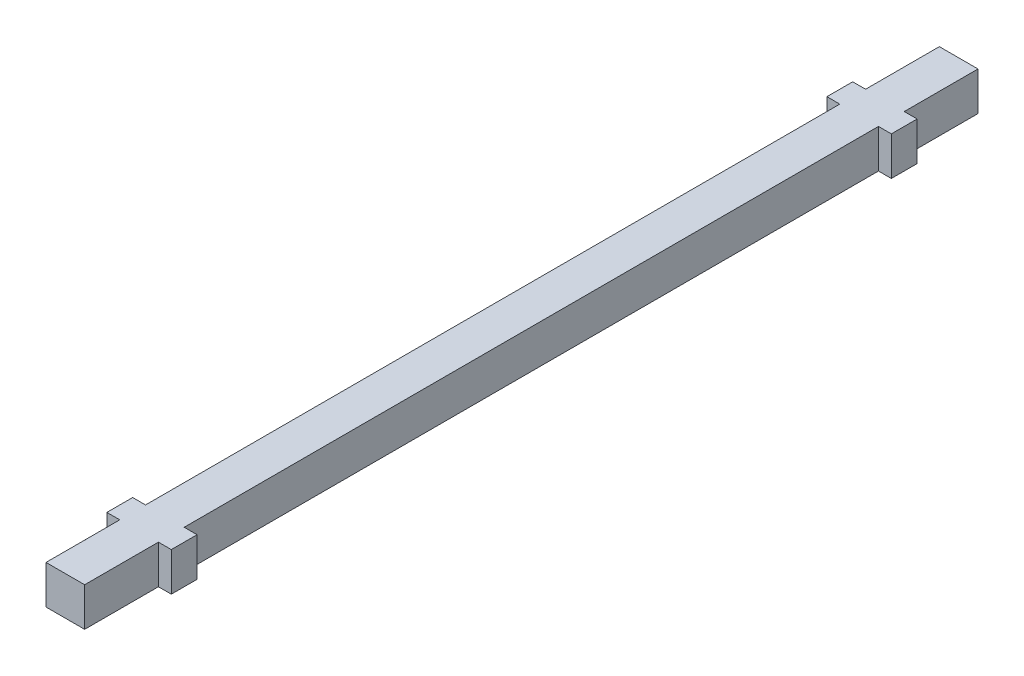
ISO-10303-21;
HEADER;
FILE_DESCRIPTION(('STEP AP214'),'2;1');
FILE_NAME('part.step','',(''),(''),'','','');
FILE_SCHEMA(('AUTOMOTIVE_DESIGN { 1 0 10303 214 1 1 1 1 }'));
ENDSEC;
DATA;
#1=APPLICATION_CONTEXT('core data for automotive mechanical design processes');
#2=APPLICATION_PROTOCOL_DEFINITION('international standard','automotive_design',2000,#1);
#3=PRODUCT_CONTEXT('',#1,'mechanical');
#4=PRODUCT('Part','Part','',(#3));
#5=PRODUCT_RELATED_PRODUCT_CATEGORY('part','',(#4));
#6=PRODUCT_DEFINITION_FORMATION('','',#4);
#7=PRODUCT_DEFINITION_CONTEXT('part definition',#1,'design');
#8=PRODUCT_DEFINITION('design','',#6,#7);
#9=PRODUCT_DEFINITION_SHAPE('','',#8);
#10=(LENGTH_UNIT() NAMED_UNIT(*) SI_UNIT(.MILLI.,.METRE.));
#11=(NAMED_UNIT(*) PLANE_ANGLE_UNIT() SI_UNIT($,.RADIAN.));
#12=(NAMED_UNIT(*) SI_UNIT($,.STERADIAN.) SOLID_ANGLE_UNIT());
#13=UNCERTAINTY_MEASURE_WITH_UNIT(LENGTH_MEASURE(1.E-05),#10,'distance_accuracy_value','');
#14=(GEOMETRIC_REPRESENTATION_CONTEXT(3) GLOBAL_UNCERTAINTY_ASSIGNED_CONTEXT((#13)) GLOBAL_UNIT_ASSIGNED_CONTEXT((#10,
#11,#12)) REPRESENTATION_CONTEXT('',''));
#15=CARTESIAN_POINT('',(0.,0.,0.));
#16=DIRECTION('',(0.,0.,1.));
#17=DIRECTION('',(1.,0.,0.));
#18=AXIS2_PLACEMENT_3D('',#15,#16,#17);
#19=CARTESIAN_POINT('',(-4.5,-4.5,104.));
#20=DIRECTION('',(1.,0.,0.));
#21=DIRECTION('',(0.,0.,-1.));
#22=AXIS2_PLACEMENT_3D('',#19,#20,#21);
#23=PLANE('',#22);
#24=DIRECTION('',(0.,-1.,0.));
#25=VECTOR('',#24,1.);
#26=CARTESIAN_POINT('',(-4.5,4.5,-86.825));
#27=LINE('',#26,#25);
#28=CARTESIAN_POINT('',(-4.5,4.5,-86.825));
#29=VERTEX_POINT('',#28);
#30=CARTESIAN_POINT('',(-4.5,-4.5,-86.825));
#31=VERTEX_POINT('',#30);
#32=EDGE_CURVE('E192',#29,#31,#27,.T.);
#33=ORIENTED_EDGE('',*,*,#32,.F.);
#34=DIRECTION('',(0.,0.,-1.));
#35=VECTOR('',#34,1.);
#36=CARTESIAN_POINT('',(-4.5,4.5,104.));
#37=LINE('',#36,#35);
#38=CARTESIAN_POINT('',(-4.5,4.5,-104.));
#39=VERTEX_POINT('',#38);
#40=EDGE_CURVE('E210',#29,#39,#37,.T.);
#41=ORIENTED_EDGE('',*,*,#40,.T.);
#42=DIRECTION('',(0.,-1.,0.));
#43=VECTOR('',#42,1.);
#44=CARTESIAN_POINT('',(-4.5,-4.5,-104.));
#45=LINE('',#44,#43);
#46=CARTESIAN_POINT('',(-4.5,-4.5,-104.));
#47=VERTEX_POINT('',#46);
#48=EDGE_CURVE('E227',#39,#47,#45,.T.);
#49=ORIENTED_EDGE('',*,*,#48,.T.);
#50=DIRECTION('',(0.,0.,-1.));
#51=VECTOR('',#50,1.);
#52=CARTESIAN_POINT('',(-4.5,-4.5,104.));
#53=LINE('',#52,#51);
#54=EDGE_CURVE('E217',#31,#47,#53,.T.);
#55=ORIENTED_EDGE('',*,*,#54,.F.);
#56=EDGE_LOOP('',(#33,#41,#49,#55));
#57=FACE_BOUND('',#56,.T.);
#58=ADVANCED_FACE('F43',(#57),#23,.F.);
#59=CARTESIAN_POINT('',(4.5,-4.5,104.));
#60=DIRECTION('',(-1.,0.,0.));
#61=DIRECTION('',(0.,0.,1.));
#62=AXIS2_PLACEMENT_3D('',#59,#60,#61);
#63=PLANE('',#62);
#64=DIRECTION('',(0.,0.,-1.));
#65=VECTOR('',#64,1.);
#66=CARTESIAN_POINT('',(4.5,-4.5,104.));
#67=LINE('',#66,#65);
#68=CARTESIAN_POINT('',(4.5,-4.5,80.825));
#69=VERTEX_POINT('',#68);
#70=CARTESIAN_POINT('',(4.5,-4.5,-80.8249999999999));
#71=VERTEX_POINT('',#70);
#72=EDGE_CURVE('E221',#69,#71,#67,.T.);
#73=ORIENTED_EDGE('',*,*,#72,.T.);
#74=DIRECTION('',(0.,-1.,0.));
#75=VECTOR('',#74,1.);
#76=CARTESIAN_POINT('',(4.5,4.5,-80.825));
#77=LINE('',#76,#75);
#78=CARTESIAN_POINT('',(4.5,4.5,-80.8249999999999));
#79=VERTEX_POINT('',#78);
#80=EDGE_CURVE('E298',#79,#71,#77,.T.);
#81=ORIENTED_EDGE('',*,*,#80,.F.);
#82=DIRECTION('',(0.,0.,-1.));
#83=VECTOR('',#82,1.);
#84=CARTESIAN_POINT('',(4.5,4.5,104.));
#85=LINE('',#84,#83);
#86=CARTESIAN_POINT('',(4.5,4.5,80.825));
#87=VERTEX_POINT('',#86);
#88=EDGE_CURVE('E51',#87,#79,#85,.T.);
#89=ORIENTED_EDGE('',*,*,#88,.F.);
#90=DIRECTION('',(0.,-1.,0.));
#91=VECTOR('',#90,1.);
#92=CARTESIAN_POINT('',(4.5,4.5,80.825));
#93=LINE('',#92,#91);
#94=EDGE_CURVE('E261',#87,#69,#93,.T.);
#95=ORIENTED_EDGE('',*,*,#94,.T.);
#96=EDGE_LOOP('',(#73,#81,#89,#95));
#97=FACE_BOUND('',#96,.T.);
#98=ADVANCED_FACE('F350',(#97),#63,.F.);
#99=DIRECTION('',(0.,-1.,0.));
#100=VECTOR('',#99,1.);
#101=CARTESIAN_POINT('',(4.5,4.5,86.825));
#102=LINE('',#101,#100);
#103=CARTESIAN_POINT('',(4.5,4.5,86.825));
#104=VERTEX_POINT('',#103);
#105=CARTESIAN_POINT('',(4.5,-4.5,86.825));
#106=VERTEX_POINT('',#105);
#107=EDGE_CURVE('E269',#104,#106,#102,.T.);
#108=ORIENTED_EDGE('',*,*,#107,.F.);
#109=CARTESIAN_POINT('',(4.5,4.5,104.));
#110=VERTEX_POINT('',#109);
#111=EDGE_CURVE('E11',#110,#104,#85,.T.);
#112=ORIENTED_EDGE('',*,*,#111,.F.);
#113=DIRECTION('',(0.,1.,0.));
#114=VECTOR('',#113,1.);
#115=CARTESIAN_POINT('',(4.5,-4.5,104.));
#116=LINE('',#115,#114);
#117=CARTESIAN_POINT('',(4.5,-4.5,104.));
#118=VERTEX_POINT('',#117);
#119=EDGE_CURVE('E226',#118,#110,#116,.T.);
#120=ORIENTED_EDGE('',*,*,#119,.F.);
#121=EDGE_CURVE('E218',#118,#106,#67,.T.);
#122=ORIENTED_EDGE('',*,*,#121,.T.);
#123=EDGE_LOOP('',(#108,#112,#120,#122));
#124=FACE_BOUND('',#123,.T.);
#125=ADVANCED_FACE('F381',(#124),#63,.F.);
#126=CARTESIAN_POINT('',(-4.5,4.5,80.825));
#127=VERTEX_POINT('',#126);
#128=CARTESIAN_POINT('',(-4.5,4.5,-80.825));
#129=VERTEX_POINT('',#128);
#130=EDGE_CURVE('E199',#127,#129,#37,.T.);
#131=ORIENTED_EDGE('',*,*,#130,.T.);
#132=DIRECTION('',(0.,-1.,0.));
#133=VECTOR('',#132,1.);
#134=CARTESIAN_POINT('',(-4.5,4.5,-80.825));
#135=LINE('',#134,#133);
#136=CARTESIAN_POINT('',(-4.5,-4.5,-80.825));
#137=VERTEX_POINT('',#136);
#138=EDGE_CURVE('E181',#129,#137,#135,.T.);
#139=ORIENTED_EDGE('',*,*,#138,.T.);
#140=CARTESIAN_POINT('',(-4.5,-4.5,80.825));
#141=VERTEX_POINT('',#140);
#142=EDGE_CURVE('E216',#141,#137,#53,.T.);
#143=ORIENTED_EDGE('',*,*,#142,.F.);
#144=DIRECTION('',(0.,-1.,0.));
#145=VECTOR('',#144,1.);
#146=CARTESIAN_POINT('',(-4.5,4.5,80.825));
#147=LINE('',#146,#145);
#148=EDGE_CURVE('E208',#127,#141,#147,.T.);
#149=ORIENTED_EDGE('',*,*,#148,.F.);
#150=EDGE_LOOP('',(#131,#139,#143,#149));
#151=FACE_BOUND('',#150,.T.);
#152=ADVANCED_FACE('F207',(#151),#23,.F.);
#153=CARTESIAN_POINT('',(4.5,4.5,-86.8249999999999));
#154=VERTEX_POINT('',#153);
#155=CARTESIAN_POINT('',(4.5,4.5,-104.));
#156=VERTEX_POINT('',#155);
#157=EDGE_CURVE('E52',#154,#156,#85,.T.);
#158=ORIENTED_EDGE('',*,*,#157,.F.);
#159=DIRECTION('',(0.,-1.,0.));
#160=VECTOR('',#159,1.);
#161=CARTESIAN_POINT('',(4.5,4.5,-86.825));
#162=LINE('',#161,#160);
#163=CARTESIAN_POINT('',(4.5,-4.5,-86.825));
#164=VERTEX_POINT('',#163);
#165=EDGE_CURVE('E296',#154,#164,#162,.T.);
#166=ORIENTED_EDGE('',*,*,#165,.T.);
#167=CARTESIAN_POINT('',(4.5,-4.5,-104.));
#168=VERTEX_POINT('',#167);
#169=EDGE_CURVE('E222',#164,#168,#67,.T.);
#170=ORIENTED_EDGE('',*,*,#169,.T.);
#171=DIRECTION('',(0.,1.,0.));
#172=VECTOR('',#171,1.);
#173=CARTESIAN_POINT('',(4.5,-4.5,-104.));
#174=LINE('',#173,#172);
#175=EDGE_CURVE('E232',#168,#156,#174,.T.);
#176=ORIENTED_EDGE('',*,*,#175,.T.);
#177=EDGE_LOOP('',(#158,#166,#170,#176));
#178=FACE_BOUND('',#177,.T.);
#179=ADVANCED_FACE('F45',(#178),#63,.F.);
#180=CARTESIAN_POINT('',(-4.5,4.5,104.));
#181=DIRECTION('',(0.,-1.,0.));
#182=DIRECTION('',(0.,0.,-1.));
#183=AXIS2_PLACEMENT_3D('',#180,#181,#182);
#184=PLANE('',#183);
#185=DIRECTION('',(-1.,0.,0.));
#186=VECTOR('',#185,1.);
#187=CARTESIAN_POINT('',(-4.5,4.5,-104.));
#188=LINE('',#187,#186);
#189=EDGE_CURVE('E230',#156,#39,#188,.T.);
#190=ORIENTED_EDGE('',*,*,#189,.T.);
#191=ORIENTED_EDGE('',*,*,#40,.F.);
#192=DIRECTION('',(-1.,0.,0.));
#193=VECTOR('',#192,1.);
#194=CARTESIAN_POINT('',(4.01646308804497E-13,4.5,-86.825));
#195=LINE('',#194,#193);
#196=CARTESIAN_POINT('',(-7.5,4.5,-86.825));
#197=VERTEX_POINT('',#196);
#198=EDGE_CURVE('E203',#29,#197,#195,.T.);
#199=ORIENTED_EDGE('',*,*,#198,.T.);
#200=DIRECTION('',(0.,0.,1.));
#201=VECTOR('',#200,1.);
#202=CARTESIAN_POINT('',(-7.5,4.5,0.));
#203=LINE('',#202,#201);
#204=CARTESIAN_POINT('',(-7.5,4.5,-80.825));
#205=VERTEX_POINT('',#204);
#206=EDGE_CURVE('E201',#197,#205,#203,.T.);
#207=ORIENTED_EDGE('',*,*,#206,.T.);
#208=DIRECTION('',(-1.,0.,0.));
#209=VECTOR('',#208,1.);
#210=CARTESIAN_POINT('',(0.,4.5,-80.825));
#211=LINE('',#210,#209);
#212=EDGE_CURVE('E184',#129,#205,#211,.T.);
#213=ORIENTED_EDGE('',*,*,#212,.F.);
#214=ORIENTED_EDGE('',*,*,#130,.F.);
#215=DIRECTION('',(1.,0.,0.));
#216=VECTOR('',#215,1.);
#217=CARTESIAN_POINT('',(0.,4.5,80.825));
#218=LINE('',#217,#216);
#219=CARTESIAN_POINT('',(-7.5,4.5,80.825));
#220=VERTEX_POINT('',#219);
#221=EDGE_CURVE('E254',#220,#127,#218,.T.);
#222=ORIENTED_EDGE('',*,*,#221,.F.);
#223=DIRECTION('',(0.,0.,1.));
#224=VECTOR('',#223,1.);
#225=CARTESIAN_POINT('',(-7.5,4.5,0.));
#226=LINE('',#225,#224);
#227=CARTESIAN_POINT('',(-7.5,4.5,86.825));
#228=VERTEX_POINT('',#227);
#229=EDGE_CURVE('E264',#220,#228,#226,.T.);
#230=ORIENTED_EDGE('',*,*,#229,.T.);
#231=DIRECTION('',(-1.,0.,0.));
#232=VECTOR('',#231,1.);
#233=CARTESIAN_POINT('',(4.01646308804497E-13,4.5,86.825));
#234=LINE('',#233,#232);
#235=CARTESIAN_POINT('',(-4.5,4.5,86.825));
#236=VERTEX_POINT('',#235);
#237=EDGE_CURVE('E250',#236,#228,#234,.T.);
#238=ORIENTED_EDGE('',*,*,#237,.F.);
#239=CARTESIAN_POINT('',(-4.5,4.5,104.));
#240=VERTEX_POINT('',#239);
#241=EDGE_CURVE('E209',#240,#236,#37,.T.);
#242=ORIENTED_EDGE('',*,*,#241,.F.);
#243=DIRECTION('',(-1.,0.,0.));
#244=VECTOR('',#243,1.);
#245=CARTESIAN_POINT('',(-4.5,4.5,104.));
#246=LINE('',#245,#244);
#247=EDGE_CURVE('E239',#110,#240,#246,.T.);
#248=ORIENTED_EDGE('',*,*,#247,.F.);
#249=ORIENTED_EDGE('',*,*,#111,.T.);
#250=DIRECTION('',(1.,0.,0.));
#251=VECTOR('',#250,1.);
#252=CARTESIAN_POINT('',(0.,4.5,86.825));
#253=LINE('',#252,#251);
#254=CARTESIAN_POINT('',(7.5,4.5,86.825));
#255=VERTEX_POINT('',#254);
#256=EDGE_CURVE('E289',#104,#255,#253,.T.);
#257=ORIENTED_EDGE('',*,*,#256,.T.);
#258=DIRECTION('',(0.,0.,1.));
#259=VECTOR('',#258,1.);
#260=CARTESIAN_POINT('',(7.5,4.5,0.));
#261=LINE('',#260,#259);
#262=CARTESIAN_POINT('',(7.5,4.5,80.825));
#263=VERTEX_POINT('',#262);
#264=EDGE_CURVE('E275',#263,#255,#261,.T.);
#265=ORIENTED_EDGE('',*,*,#264,.F.);
#266=DIRECTION('',(1.,0.,0.));
#267=VECTOR('',#266,1.);
#268=CARTESIAN_POINT('',(0.,4.5,80.825));
#269=LINE('',#268,#267);
#270=EDGE_CURVE('E279',#87,#263,#269,.T.);
#271=ORIENTED_EDGE('',*,*,#270,.F.);
#272=ORIENTED_EDGE('',*,*,#88,.T.);
#273=DIRECTION('',(-1.,0.,0.));
#274=VECTOR('',#273,1.);
#275=CARTESIAN_POINT('',(0.,4.5,-80.825));
#276=LINE('',#275,#274);
#277=CARTESIAN_POINT('',(7.5,4.5,-80.825));
#278=VERTEX_POINT('',#277);
#279=EDGE_CURVE('E305',#278,#79,#276,.T.);
#280=ORIENTED_EDGE('',*,*,#279,.F.);
#281=DIRECTION('',(0.,0.,1.));
#282=VECTOR('',#281,1.);
#283=CARTESIAN_POINT('',(7.5,4.5,0.));
#284=LINE('',#283,#282);
#285=CARTESIAN_POINT('',(7.5,4.5,-86.825));
#286=VERTEX_POINT('',#285);
#287=EDGE_CURVE('E313',#286,#278,#284,.T.);
#288=ORIENTED_EDGE('',*,*,#287,.F.);
#289=DIRECTION('',(1.,0.,0.));
#290=VECTOR('',#289,1.);
#291=CARTESIAN_POINT('',(0.,4.5,-86.825));
#292=LINE('',#291,#290);
#293=EDGE_CURVE('E301',#154,#286,#292,.T.);
#294=ORIENTED_EDGE('',*,*,#293,.F.);
#295=ORIENTED_EDGE('',*,*,#157,.T.);
#296=EDGE_LOOP('',(#190,#191,#199,#207,#213,#214,#222,#230,#238,#242,#248,#249,#257,#265,#271,
#272,#280,#288,#294,#295));
#297=FACE_BOUND('',#296,.T.);
#298=ADVANCED_FACE('F197',(#297),#184,.F.);
#299=ORIENTED_EDGE('',*,*,#241,.T.);
#300=DIRECTION('',(0.,-1.,0.));
#301=VECTOR('',#300,1.);
#302=CARTESIAN_POINT('',(-4.5,4.5,86.825));
#303=LINE('',#302,#301);
#304=CARTESIAN_POINT('',(-4.5,-4.5,86.825));
#305=VERTEX_POINT('',#304);
#306=EDGE_CURVE('E246',#236,#305,#303,.T.);
#307=ORIENTED_EDGE('',*,*,#306,.T.);
#308=CARTESIAN_POINT('',(-4.5,-4.5,104.));
#309=VERTEX_POINT('',#308);
#310=EDGE_CURVE('E212',#309,#305,#53,.T.);
#311=ORIENTED_EDGE('',*,*,#310,.F.);
#312=DIRECTION('',(0.,-1.,0.));
#313=VECTOR('',#312,1.);
#314=CARTESIAN_POINT('',(-4.5,-4.5,104.));
#315=LINE('',#314,#313);
#316=EDGE_CURVE('E237',#240,#309,#315,.T.);
#317=ORIENTED_EDGE('',*,*,#316,.F.);
#318=EDGE_LOOP('',(#299,#307,#311,#317));
#319=FACE_BOUND('',#318,.T.);
#320=ADVANCED_FACE('F376',(#319),#23,.F.);
#321=CARTESIAN_POINT('',(-4.5,-4.5,104.));
#322=DIRECTION('',(0.,1.,0.));
#323=DIRECTION('',(0.,0.,1.));
#324=AXIS2_PLACEMENT_3D('',#321,#322,#323);
#325=PLANE('',#324);
#326=DIRECTION('',(1.,0.,0.));
#327=VECTOR('',#326,1.);
#328=CARTESIAN_POINT('',(-4.5,-4.5,-104.));
#329=LINE('',#328,#327);
#330=EDGE_CURVE('E223',#47,#168,#329,.T.);
#331=ORIENTED_EDGE('',*,*,#330,.T.);
#332=ORIENTED_EDGE('',*,*,#169,.F.);
#333=DIRECTION('',(1.,0.,0.));
#334=VECTOR('',#333,1.);
#335=CARTESIAN_POINT('',(0.,-4.5,-86.825));
#336=LINE('',#335,#334);
#337=CARTESIAN_POINT('',(7.5,-4.5,-86.825));
#338=VERTEX_POINT('',#337);
#339=EDGE_CURVE('E302',#164,#338,#336,.T.);
#340=ORIENTED_EDGE('',*,*,#339,.T.);
#341=DIRECTION('',(0.,0.,1.));
#342=VECTOR('',#341,1.);
#343=CARTESIAN_POINT('',(7.5,-4.5,0.));
#344=LINE('',#343,#342);
#345=CARTESIAN_POINT('',(7.5,-4.5,-80.825));
#346=VERTEX_POINT('',#345);
#347=EDGE_CURVE('E306',#338,#346,#344,.T.);
#348=ORIENTED_EDGE('',*,*,#347,.T.);
#349=DIRECTION('',(-1.,0.,0.));
#350=VECTOR('',#349,1.);
#351=CARTESIAN_POINT('',(0.,-4.5,-80.825));
#352=LINE('',#351,#350);
#353=EDGE_CURVE('E191',#346,#71,#352,.T.);
#354=ORIENTED_EDGE('',*,*,#353,.T.);
#355=ORIENTED_EDGE('',*,*,#72,.F.);
#356=DIRECTION('',(1.,0.,0.));
#357=VECTOR('',#356,1.);
#358=CARTESIAN_POINT('',(0.,-4.5,80.825));
#359=LINE('',#358,#357);
#360=CARTESIAN_POINT('',(7.5,-4.5,80.825));
#361=VERTEX_POINT('',#360);
#362=EDGE_CURVE('E283',#69,#361,#359,.T.);
#363=ORIENTED_EDGE('',*,*,#362,.T.);
#364=DIRECTION('',(0.,0.,1.));
#365=VECTOR('',#364,1.);
#366=CARTESIAN_POINT('',(7.5,-4.5,0.));
#367=LINE('',#366,#365);
#368=CARTESIAN_POINT('',(7.5,-4.5,86.825));
#369=VERTEX_POINT('',#368);
#370=EDGE_CURVE('E276',#361,#369,#367,.T.);
#371=ORIENTED_EDGE('',*,*,#370,.T.);
#372=DIRECTION('',(1.,0.,0.));
#373=VECTOR('',#372,1.);
#374=CARTESIAN_POINT('',(0.,-4.5,86.825));
#375=LINE('',#374,#373);
#376=EDGE_CURVE('E280',#106,#369,#375,.T.);
#377=ORIENTED_EDGE('',*,*,#376,.F.);
#378=ORIENTED_EDGE('',*,*,#121,.F.);
#379=DIRECTION('',(1.,0.,0.));
#380=VECTOR('',#379,1.);
#381=CARTESIAN_POINT('',(-4.5,-4.5,104.));
#382=LINE('',#381,#380);
#383=EDGE_CURVE('E235',#309,#118,#382,.T.);
#384=ORIENTED_EDGE('',*,*,#383,.F.);
#385=ORIENTED_EDGE('',*,*,#310,.T.);
#386=DIRECTION('',(-1.,0.,0.));
#387=VECTOR('',#386,1.);
#388=CARTESIAN_POINT('',(4.01646308804497E-13,-4.5,86.825));
#389=LINE('',#388,#387);
#390=CARTESIAN_POINT('',(-7.5,-4.5,86.825));
#391=VERTEX_POINT('',#390);
#392=EDGE_CURVE('E251',#305,#391,#389,.T.);
#393=ORIENTED_EDGE('',*,*,#392,.T.);
#394=DIRECTION('',(0.,0.,1.));
#395=VECTOR('',#394,1.);
#396=CARTESIAN_POINT('',(-7.5,-4.5,0.));
#397=LINE('',#396,#395);
#398=CARTESIAN_POINT('',(-7.5,-4.5,80.825));
#399=VERTEX_POINT('',#398);
#400=EDGE_CURVE('E255',#399,#391,#397,.T.);
#401=ORIENTED_EDGE('',*,*,#400,.F.);
#402=DIRECTION('',(1.,0.,0.));
#403=VECTOR('',#402,1.);
#404=CARTESIAN_POINT('',(0.,-4.5,80.825));
#405=LINE('',#404,#403);
#406=EDGE_CURVE('E258',#399,#141,#405,.T.);
#407=ORIENTED_EDGE('',*,*,#406,.T.);
#408=ORIENTED_EDGE('',*,*,#142,.T.);
#409=DIRECTION('',(-1.,0.,0.));
#410=VECTOR('',#409,1.);
#411=CARTESIAN_POINT('',(0.,-4.5,-80.825));
#412=LINE('',#411,#410);
#413=CARTESIAN_POINT('',(-7.5,-4.5,-80.825));
#414=VERTEX_POINT('',#413);
#415=EDGE_CURVE('E186',#137,#414,#412,.T.);
#416=ORIENTED_EDGE('',*,*,#415,.T.);
#417=DIRECTION('',(0.,0.,1.));
#418=VECTOR('',#417,1.);
#419=CARTESIAN_POINT('',(-7.5,-4.5,0.));
#420=LINE('',#419,#418);
#421=CARTESIAN_POINT('',(-7.5,-4.5,-86.825));
#422=VERTEX_POINT('',#421);
#423=EDGE_CURVE('E204',#422,#414,#420,.T.);
#424=ORIENTED_EDGE('',*,*,#423,.F.);
#425=DIRECTION('',(-1.,0.,0.));
#426=VECTOR('',#425,1.);
#427=CARTESIAN_POINT('',(4.01646308804497E-13,-4.5,-86.825));
#428=LINE('',#427,#426);
#429=EDGE_CURVE('E59',#31,#422,#428,.T.);
#430=ORIENTED_EDGE('',*,*,#429,.F.);
#431=ORIENTED_EDGE('',*,*,#54,.T.);
#432=EDGE_LOOP('',(#331,#332,#340,#348,#354,#355,#363,#371,#377,#378,#384,#385,#393,#401,#407,
#408,#416,#424,#430,#431));
#433=FACE_BOUND('',#432,.T.);
#434=ADVANCED_FACE('F336',(#433),#325,.F.);
#435=CARTESIAN_POINT('',(0.,0.,104.));
#436=DIRECTION('',(0.,0.,-1.));
#437=DIRECTION('',(-1.,0.,0.));
#438=AXIS2_PLACEMENT_3D('',#435,#436,#437);
#439=PLANE('',#438);
#440=ORIENTED_EDGE('',*,*,#119,.T.);
#441=ORIENTED_EDGE('',*,*,#247,.T.);
#442=ORIENTED_EDGE('',*,*,#316,.T.);
#443=ORIENTED_EDGE('',*,*,#383,.T.);
#444=EDGE_LOOP('',(#440,#441,#442,#443));
#445=FACE_BOUND('',#444,.T.);
#446=ADVANCED_FACE('F390',(#445),#439,.F.);
#447=CARTESIAN_POINT('',(0.,0.,-104.));
#448=DIRECTION('',(0.,0.,-1.));
#449=DIRECTION('',(-1.,0.,0.));
#450=AXIS2_PLACEMENT_3D('',#447,#448,#449);
#451=PLANE('',#450);
#452=ORIENTED_EDGE('',*,*,#175,.F.);
#453=ORIENTED_EDGE('',*,*,#330,.F.);
#454=ORIENTED_EDGE('',*,*,#48,.F.);
#455=ORIENTED_EDGE('',*,*,#189,.F.);
#456=EDGE_LOOP('',(#452,#453,#454,#455));
#457=FACE_BOUND('',#456,.T.);
#458=ADVANCED_FACE('F346',(#457),#451,.T.);
#459=CARTESIAN_POINT('',(0.,4.5,80.825));
#460=DIRECTION('',(0.,0.,-1.));
#461=DIRECTION('',(-1.,0.,0.));
#462=AXIS2_PLACEMENT_3D('',#459,#460,#461);
#463=PLANE('',#462);
#464=ORIENTED_EDGE('',*,*,#406,.F.);
#465=DIRECTION('',(0.,-1.,0.));
#466=VECTOR('',#465,1.);
#467=CARTESIAN_POINT('',(-7.5,4.5,80.825));
#468=LINE('',#467,#466);
#469=EDGE_CURVE('E234',#220,#399,#468,.T.);
#470=ORIENTED_EDGE('',*,*,#469,.F.);
#471=ORIENTED_EDGE('',*,*,#221,.T.);
#472=ORIENTED_EDGE('',*,*,#148,.T.);
#473=EDGE_LOOP('',(#464,#470,#471,#472));
#474=FACE_BOUND('',#473,.T.);
#475=ADVANCED_FACE('F428',(#474),#463,.T.);
#476=CARTESIAN_POINT('',(-7.5,4.5,0.));
#477=DIRECTION('',(1.,0.,0.));
#478=DIRECTION('',(0.,0.,-1.));
#479=AXIS2_PLACEMENT_3D('',#476,#477,#478);
#480=PLANE('',#479);
#481=ORIENTED_EDGE('',*,*,#400,.T.);
#482=DIRECTION('',(0.,-1.,0.));
#483=VECTOR('',#482,1.);
#484=CARTESIAN_POINT('',(-7.5,4.5,86.825));
#485=LINE('',#484,#483);
#486=EDGE_CURVE('E244',#228,#391,#485,.T.);
#487=ORIENTED_EDGE('',*,*,#486,.F.);
#488=ORIENTED_EDGE('',*,*,#229,.F.);
#489=ORIENTED_EDGE('',*,*,#469,.T.);
#490=EDGE_LOOP('',(#481,#487,#488,#489));
#491=FACE_BOUND('',#490,.T.);
#492=ADVANCED_FACE('F422',(#491),#480,.F.);
#493=CARTESIAN_POINT('',(4.01646308804497E-13,4.5,86.825));
#494=DIRECTION('',(0.,0.,1.));
#495=DIRECTION('',(1.,0.,0.));
#496=AXIS2_PLACEMENT_3D('',#493,#494,#495);
#497=PLANE('',#496);
#498=ORIENTED_EDGE('',*,*,#392,.F.);
#499=ORIENTED_EDGE('',*,*,#306,.F.);
#500=ORIENTED_EDGE('',*,*,#237,.T.);
#501=ORIENTED_EDGE('',*,*,#486,.T.);
#502=EDGE_LOOP('',(#498,#499,#500,#501));
#503=FACE_BOUND('',#502,.T.);
#504=ADVANCED_FACE('F398',(#503),#497,.T.);
#505=CARTESIAN_POINT('',(0.,4.5,80.825));
#506=DIRECTION('',(0.,0.,-1.));
#507=DIRECTION('',(-1.,0.,0.));
#508=AXIS2_PLACEMENT_3D('',#505,#506,#507);
#509=PLANE('',#508);
#510=ORIENTED_EDGE('',*,*,#362,.F.);
#511=ORIENTED_EDGE('',*,*,#94,.F.);
#512=ORIENTED_EDGE('',*,*,#270,.T.);
#513=DIRECTION('',(0.,-1.,0.));
#514=VECTOR('',#513,1.);
#515=CARTESIAN_POINT('',(7.5,4.5,80.825));
#516=LINE('',#515,#514);
#517=EDGE_CURVE('E273',#263,#361,#516,.T.);
#518=ORIENTED_EDGE('',*,*,#517,.T.);
#519=EDGE_LOOP('',(#510,#511,#512,#518));
#520=FACE_BOUND('',#519,.T.);
#521=ADVANCED_FACE('F414',(#520),#509,.T.);
#522=CARTESIAN_POINT('',(0.,4.5,86.825));
#523=DIRECTION('',(0.,0.,-1.));
#524=DIRECTION('',(-1.,0.,0.));
#525=AXIS2_PLACEMENT_3D('',#522,#523,#524);
#526=PLANE('',#525);
#527=ORIENTED_EDGE('',*,*,#376,.T.);
#528=DIRECTION('',(0.,-1.,0.));
#529=VECTOR('',#528,1.);
#530=CARTESIAN_POINT('',(7.5,4.5,86.825));
#531=LINE('',#530,#529);
#532=EDGE_CURVE('E271',#255,#369,#531,.T.);
#533=ORIENTED_EDGE('',*,*,#532,.F.);
#534=ORIENTED_EDGE('',*,*,#256,.F.);
#535=ORIENTED_EDGE('',*,*,#107,.T.);
#536=EDGE_LOOP('',(#527,#533,#534,#535));
#537=FACE_BOUND('',#536,.T.);
#538=ADVANCED_FACE('F409',(#537),#526,.F.);
#539=CARTESIAN_POINT('',(7.5,4.5,0.));
#540=DIRECTION('',(1.,0.,0.));
#541=DIRECTION('',(0.,0.,-1.));
#542=AXIS2_PLACEMENT_3D('',#539,#540,#541);
#543=PLANE('',#542);
#544=ORIENTED_EDGE('',*,*,#370,.F.);
#545=ORIENTED_EDGE('',*,*,#517,.F.);
#546=ORIENTED_EDGE('',*,*,#264,.T.);
#547=ORIENTED_EDGE('',*,*,#532,.T.);
#548=EDGE_LOOP('',(#544,#545,#546,#547));
#549=FACE_BOUND('',#548,.T.);
#550=ADVANCED_FACE('F412',(#549),#543,.T.);
#551=CARTESIAN_POINT('',(0.,4.5,-80.825));
#552=DIRECTION('',(0.,0.,1.));
#553=DIRECTION('',(1.,0.,0.));
#554=AXIS2_PLACEMENT_3D('',#551,#552,#553);
#555=PLANE('',#554);
#556=ORIENTED_EDGE('',*,*,#353,.F.);
#557=DIRECTION('',(0.,-1.,0.));
#558=VECTOR('',#557,1.);
#559=CARTESIAN_POINT('',(7.5,4.5,-80.825));
#560=LINE('',#559,#558);
#561=EDGE_CURVE('E286',#278,#346,#560,.T.);
#562=ORIENTED_EDGE('',*,*,#561,.F.);
#563=ORIENTED_EDGE('',*,*,#279,.T.);
#564=ORIENTED_EDGE('',*,*,#80,.T.);
#565=EDGE_LOOP('',(#556,#562,#563,#564));
#566=FACE_BOUND('',#565,.T.);
#567=ADVANCED_FACE('F355',(#566),#555,.T.);
#568=CARTESIAN_POINT('',(7.5,4.5,0.));
#569=DIRECTION('',(1.,0.,0.));
#570=DIRECTION('',(0.,0.,-1.));
#571=AXIS2_PLACEMENT_3D('',#568,#569,#570);
#572=PLANE('',#571);
#573=ORIENTED_EDGE('',*,*,#347,.F.);
#574=DIRECTION('',(0.,-1.,0.));
#575=VECTOR('',#574,1.);
#576=CARTESIAN_POINT('',(7.5,4.5,-86.825));
#577=LINE('',#576,#575);
#578=EDGE_CURVE('E294',#286,#338,#577,.T.);
#579=ORIENTED_EDGE('',*,*,#578,.F.);
#580=ORIENTED_EDGE('',*,*,#287,.T.);
#581=ORIENTED_EDGE('',*,*,#561,.T.);
#582=EDGE_LOOP('',(#573,#579,#580,#581));
#583=FACE_BOUND('',#582,.T.);
#584=ADVANCED_FACE('F359',(#583),#572,.T.);
#585=CARTESIAN_POINT('',(0.,4.5,-86.825));
#586=DIRECTION('',(0.,0.,-1.));
#587=DIRECTION('',(-1.,0.,0.));
#588=AXIS2_PLACEMENT_3D('',#585,#586,#587);
#589=PLANE('',#588);
#590=ORIENTED_EDGE('',*,*,#339,.F.);
#591=ORIENTED_EDGE('',*,*,#165,.F.);
#592=ORIENTED_EDGE('',*,*,#293,.T.);
#593=ORIENTED_EDGE('',*,*,#578,.T.);
#594=EDGE_LOOP('',(#590,#591,#592,#593));
#595=FACE_BOUND('',#594,.T.);
#596=ADVANCED_FACE('F365',(#595),#589,.T.);
#597=CARTESIAN_POINT('',(0.,4.5,-80.825));
#598=DIRECTION('',(0.,0.,1.));
#599=DIRECTION('',(1.,0.,0.));
#600=AXIS2_PLACEMENT_3D('',#597,#598,#599);
#601=PLANE('',#600);
#602=ORIENTED_EDGE('',*,*,#415,.F.);
#603=ORIENTED_EDGE('',*,*,#138,.F.);
#604=ORIENTED_EDGE('',*,*,#212,.T.);
#605=DIRECTION('',(0.,-1.,0.));
#606=VECTOR('',#605,1.);
#607=CARTESIAN_POINT('',(-7.5,4.5,-80.825));
#608=LINE('',#607,#606);
#609=EDGE_CURVE('E322',#205,#414,#608,.T.);
#610=ORIENTED_EDGE('',*,*,#609,.T.);
#611=EDGE_LOOP('',(#602,#603,#604,#610));
#612=FACE_BOUND('',#611,.T.);
#613=ADVANCED_FACE('F183',(#612),#601,.T.);
#614=CARTESIAN_POINT('',(4.01646308804497E-13,4.5,-86.825));
#615=DIRECTION('',(0.,0.,1.));
#616=DIRECTION('',(1.,0.,0.));
#617=AXIS2_PLACEMENT_3D('',#614,#615,#616);
#618=PLANE('',#617);
#619=ORIENTED_EDGE('',*,*,#429,.T.);
#620=DIRECTION('',(0.,-1.,0.));
#621=VECTOR('',#620,1.);
#622=CARTESIAN_POINT('',(-7.5,4.5,-86.825));
#623=LINE('',#622,#621);
#624=EDGE_CURVE('E319',#197,#422,#623,.T.);
#625=ORIENTED_EDGE('',*,*,#624,.F.);
#626=ORIENTED_EDGE('',*,*,#198,.F.);
#627=ORIENTED_EDGE('',*,*,#32,.T.);
#628=EDGE_LOOP('',(#619,#625,#626,#627));
#629=FACE_BOUND('',#628,.T.);
#630=ADVANCED_FACE('F333',(#629),#618,.F.);
#631=CARTESIAN_POINT('',(-7.5,4.5,0.));
#632=DIRECTION('',(1.,0.,0.));
#633=DIRECTION('',(0.,0.,-1.));
#634=AXIS2_PLACEMENT_3D('',#631,#632,#633);
#635=PLANE('',#634);
#636=ORIENTED_EDGE('',*,*,#423,.T.);
#637=ORIENTED_EDGE('',*,*,#609,.F.);
#638=ORIENTED_EDGE('',*,*,#206,.F.);
#639=ORIENTED_EDGE('',*,*,#624,.T.);
#640=EDGE_LOOP('',(#636,#637,#638,#639));
#641=FACE_BOUND('',#640,.T.);
#642=ADVANCED_FACE('F335',(#641),#635,.F.);
#643=CLOSED_SHELL('',(#58,#98,#125,#152,#179,#298,#320,#434,#446,#458,#475,#492,#504,#521,#538,
#550,#567,#584,#596,#613,#630,#642));
#644=MANIFOLD_SOLID_BREP('B2',#643);
#645=ADVANCED_BREP_SHAPE_REPRESENTATION('',(#18,#644),#14);
#646=SHAPE_DEFINITION_REPRESENTATION(#9,#645);
ENDSEC;
END-ISO-10303-21;
